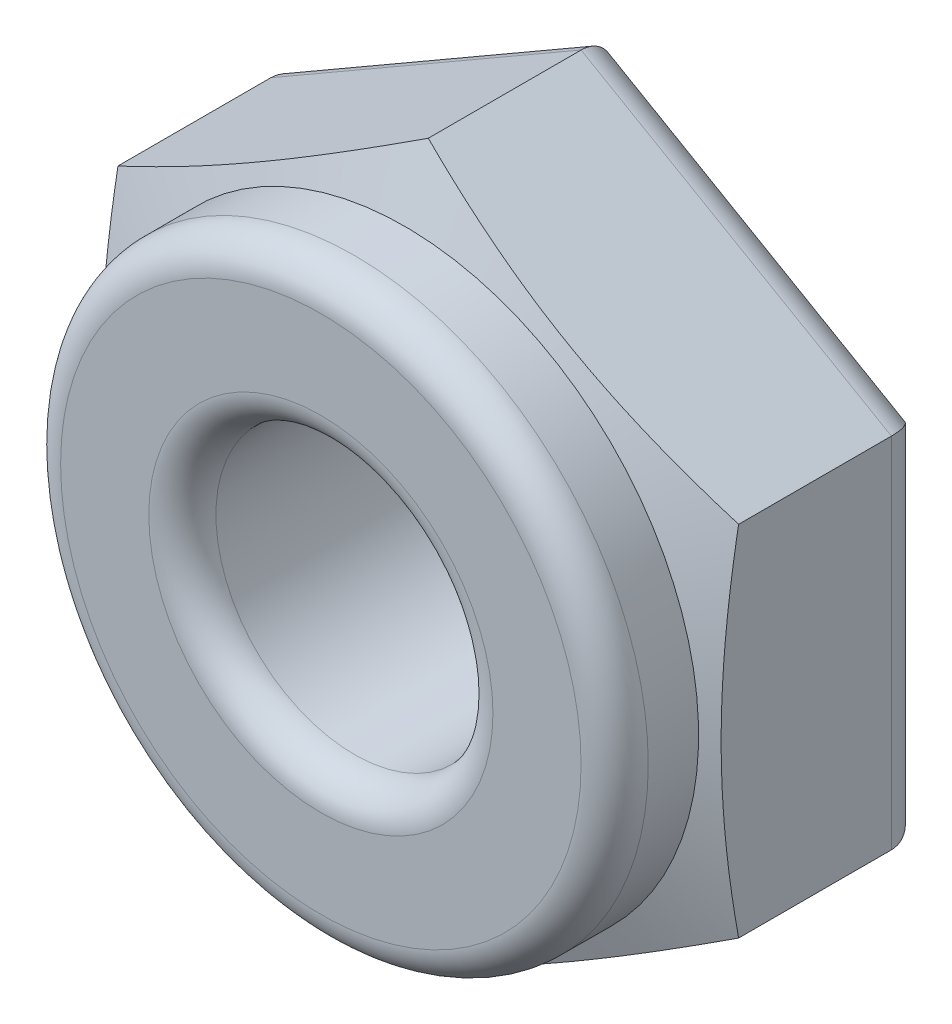
ISO-10303-21;
HEADER;
FILE_DESCRIPTION(('STEP AP214'),'2;1');
FILE_NAME('part.step','',(''),(''),'','','');
FILE_SCHEMA(('AUTOMOTIVE_DESIGN { 1 0 10303 214 1 1 1 1 }'));
ENDSEC;
DATA;
#1=APPLICATION_CONTEXT('core data for automotive mechanical design processes');
#2=APPLICATION_PROTOCOL_DEFINITION('international standard','automotive_design',2000,#1);
#3=PRODUCT_CONTEXT('',#1,'mechanical');
#4=PRODUCT('Part','Part','',(#3));
#5=PRODUCT_RELATED_PRODUCT_CATEGORY('part','',(#4));
#6=PRODUCT_DEFINITION_FORMATION('','',#4);
#7=PRODUCT_DEFINITION_CONTEXT('part definition',#1,'design');
#8=PRODUCT_DEFINITION('design','',#6,#7);
#9=PRODUCT_DEFINITION_SHAPE('','',#8);
#10=(LENGTH_UNIT() NAMED_UNIT(*) SI_UNIT(.MILLI.,.METRE.));
#11=(NAMED_UNIT(*) PLANE_ANGLE_UNIT() SI_UNIT($,.RADIAN.));
#12=(NAMED_UNIT(*) SI_UNIT($,.STERADIAN.) SOLID_ANGLE_UNIT());
#13=UNCERTAINTY_MEASURE_WITH_UNIT(LENGTH_MEASURE(1.E-05),#10,'distance_accuracy_value','');
#14=(GEOMETRIC_REPRESENTATION_CONTEXT(3) GLOBAL_UNCERTAINTY_ASSIGNED_CONTEXT((#13)) GLOBAL_UNIT_ASSIGNED_CONTEXT((#10,
#11,#12)) REPRESENTATION_CONTEXT('',''));
#15=CARTESIAN_POINT('',(0.,0.,0.));
#16=DIRECTION('',(0.,0.,1.));
#17=DIRECTION('',(1.,0.,0.));
#18=AXIS2_PLACEMENT_3D('',#15,#16,#17);
#19=CARTESIAN_POINT('',(0.,0.,4.445));
#20=DIRECTION('',(0.,0.,-1.));
#21=DIRECTION('',(-1.,0.,0.));
#22=AXIS2_PLACEMENT_3D('',#19,#20,#21);
#23=CYLINDRICAL_SURFACE('',#22,4.445);
#24=CARTESIAN_POINT('',(0.,0.,3.1749999999704));
#25=DIRECTION('',(0.,0.,-1.));
#26=DIRECTION('',(-1.,0.,0.));
#27=AXIS2_PLACEMENT_3D('',#24,#25,#26);
#28=CIRCLE('',#27,4.44499999997561);
#29=CARTESIAN_POINT('',(-4.44499999997561,0.,3.1749999999704));
#30=VERTEX_POINT('',#29);
#31=EDGE_CURVE('E308',#30,#30,#28,.T.);
#32=ORIENTED_EDGE('',*,*,#31,.F.);
#33=EDGE_LOOP('',(#32));
#34=FACE_BOUND('',#33,.T.);
#35=CARTESIAN_POINT('',(0.,0.,3.937));
#36=DIRECTION('',(0.,0.,1.));
#37=DIRECTION('',(1.,0.,0.));
#38=AXIS2_PLACEMENT_3D('',#35,#36,#37);
#39=CIRCLE('',#38,4.445);
#40=CARTESIAN_POINT('',(4.445,0.,3.937));
#41=VERTEX_POINT('',#40);
#42=EDGE_CURVE('E316',#41,#41,#39,.T.);
#43=ORIENTED_EDGE('',*,*,#42,.F.);
#44=EDGE_LOOP('',(#43));
#45=FACE_BOUND('',#44,.T.);
#46=ADVANCED_FACE('F17',(#34,#45),#23,.T.);
#47=CARTESIAN_POINT('',(0.,0.,3.937));
#48=DIRECTION('',(0.,0.,1.));
#49=DIRECTION('',(1.,0.,0.));
#50=AXIS2_PLACEMENT_3D('',#47,#48,#49);
#51=TOROIDAL_SURFACE('',#50,3.937,0.508);
#52=ORIENTED_EDGE('',*,*,#42,.T.);
#53=EDGE_LOOP('',(#52));
#54=FACE_BOUND('',#53,.T.);
#55=CARTESIAN_POINT('',(0.,0.,4.445));
#56=DIRECTION('',(0.,0.,-1.));
#57=DIRECTION('',(1.,0.,0.));
#58=AXIS2_PLACEMENT_3D('',#55,#56,#57);
#59=CIRCLE('',#58,3.937);
#60=CARTESIAN_POINT('',(-3.937,0.,4.445));
#61=VERTEX_POINT('',#60);
#62=CARTESIAN_POINT('',(3.937,0.,4.445));
#63=VERTEX_POINT('',#62);
#64=EDGE_CURVE('E123',#61,#63,#59,.F.);
#65=ORIENTED_EDGE('',*,*,#64,.F.);
#66=CARTESIAN_POINT('',(0.,0.,4.445));
#67=DIRECTION('',(0.,0.,-1.));
#68=DIRECTION('',(-1.,0.,0.));
#69=AXIS2_PLACEMENT_3D('',#66,#67,#68);
#70=CIRCLE('',#69,3.937);
#71=EDGE_CURVE('E96',#63,#61,#70,.F.);
#72=ORIENTED_EDGE('',*,*,#71,.F.);
#73=EDGE_LOOP('',(#65,#72));
#74=FACE_BOUND('',#73,.T.);
#75=ADVANCED_FACE('F163',(#54,#74),#51,.T.);
#76=CARTESIAN_POINT('',(0.,0.,2.81751682840081));
#77=DIRECTION('',(0.,0.,-1.));
#78=DIRECTION('',(-1.,0.,0.));
#79=AXIS2_PLACEMENT_3D('',#76,#77,#78);
#80=CONICAL_SURFACE('',#79,5.42717694173689,1.22173047639483);
#81=CARTESIAN_POINT('',(3.71810447639347E-12,-5.42131902768844,2.81964893474934));
#82=CARTESIAN_POINT('',(0.194430301531525,-5.30906464076274,2.86051962807064));
#83=CARTESIAN_POINT('',(0.389501710336724,-5.19644011037786,2.89769845795515));
#84=CARTESIAN_POINT('',(0.780912782140721,-4.97045882270802,2.96310868628109));
#85=CARTESIAN_POINT('',(0.977253315523539,-4.85710156290662,2.99133308472074));
#86=CARTESIAN_POINT('',(1.36902392099259,-4.63091269837848,3.03698517918679));
#87=CARTESIAN_POINT('',(1.56444504779066,-4.51808625821627,3.05451244013131));
#88=CARTESIAN_POINT('',(1.95574424899332,-4.29216955906824,3.07802140706483));
#89=CARTESIAN_POINT('',(2.15162212449666,-4.17907941491809,3.08400744141009));
#90=CARTESIAN_POINT('',(2.54337787550335,-3.95289912661779,3.08400744141009));
#91=CARTESIAN_POINT('',(2.73925575100669,-3.83980898246765,3.07802140706483));
#92=CARTESIAN_POINT('',(3.13055495220934,-3.61389228331961,3.05451244013131));
#93=CARTESIAN_POINT('',(3.32597607900741,-3.5010658431574,3.03698517918679));
#94=CARTESIAN_POINT('',(3.71774668447647,-3.27487697862926,2.99133308472074));
#95=CARTESIAN_POINT('',(3.91408721785928,-3.16151971882786,2.96310868628109));
#96=CARTESIAN_POINT('',(4.30549828966328,-2.93553843115802,2.89769845795515));
#97=CARTESIAN_POINT('',(4.50056969846848,-2.82291390077314,2.86051962807064));
#98=CARTESIAN_POINT('',(4.69499999999629,-2.71065951384744,2.81964893474934));
#99=B_SPLINE_CURVE_WITH_KNOTS('',3,(#81,#82,#83,#84,#85,#86,#87,#88,#89,#90,#91,#92,#93,#94,#95,
#96,#97,#98),.UNSPECIFIED.,.F.,.F.,(4,2,2,2,2,2,2,2,4),(0.,0.684666414958523,1.36986674698498,
2.04858815775377,2.72705497513833,3.40552179252289,4.08424320329169,4.76944353531814,
5.45410995027667),.UNSPECIFIED.);
#100=CARTESIAN_POINT('',(0.,-5.42131902768844,2.81964893474934));
#101=VERTEX_POINT('',#100);
#102=CARTESIAN_POINT('',(4.69499999999814,-2.71065951384422,2.81964893474934));
#103=VERTEX_POINT('',#102);
#104=EDGE_CURVE('E178',#101,#103,#99,.T.);
#105=ORIENTED_EDGE('',*,*,#104,.T.);
#106=CARTESIAN_POINT('',(4.695,-2.71065951384101,2.81964893474934));
#107=CARTESIAN_POINT('',(4.69500000000054,-2.48615073998959,2.86051962807102));
#108=CARTESIAN_POINT('',(4.69500000000027,-2.26090167921981,2.89769845795535));
#109=CARTESIAN_POINT('',(4.69499999999973,-1.80893910388025,2.96310868628089));
#110=CARTESIAN_POINT('',(4.69499999999946,-1.58222458427758,2.99133308472033));
#111=CARTESIAN_POINT('',(4.69500000000054,-1.12984685522145,3.03698517918714));
#112=CARTESIAN_POINT('',(4.69500000000187,-0.904193974897045,3.05451244013259));
#113=CARTESIAN_POINT('',(4.69499999999813,-0.452360576600855,3.07802140706352));
#114=CARTESIAN_POINT('',(4.69499999999306,-0.226180288300427,3.08400744140524));
#115=CARTESIAN_POINT('',(4.69499999999306,0.226180288300428,3.08400744140524));
#116=CARTESIAN_POINT('',(4.69499999999813,0.452360576600856,3.07802140706352));
#117=CARTESIAN_POINT('',(4.69500000000187,0.904193974897045,3.05451244013259));
#118=CARTESIAN_POINT('',(4.69500000000054,1.12984685522145,3.03698517918714));
#119=CARTESIAN_POINT('',(4.69499999999946,1.58222458427757,2.99133308472033));
#120=CARTESIAN_POINT('',(4.69499999999973,1.80893910388025,2.96310868628089));
#121=CARTESIAN_POINT('',(4.69500000000027,2.26090167921981,2.89769845795535));
#122=CARTESIAN_POINT('',(4.69500000000054,2.48615073998959,2.86051962807102));
#123=CARTESIAN_POINT('',(4.695,2.710659513841,2.81964893474935));
#124=B_SPLINE_CURVE_WITH_KNOTS('',3,(#106,#107,#108,#109,#110,#111,#112,#113,#114,#115,#116,
#117,#118,#119,#120,#121,#122,#123),.UNSPECIFIED.,.F.,.F.,(4,2,2,2,2,2,2,2,4),(0.,
0.684666414958581,1.36986674698462,2.04858815775341,2.72705497513821,3.40552179252301,
4.0842432032918,4.76944353531784,5.45410995027642),.UNSPECIFIED.);
#125=CARTESIAN_POINT('',(4.69499999999814,2.71065951384422,2.81964893474934));
#126=VERTEX_POINT('',#125);
#127=EDGE_CURVE('E170',#103,#126,#124,.T.);
#128=ORIENTED_EDGE('',*,*,#127,.T.);
#129=CARTESIAN_POINT('',(4.69499999999629,2.71065951384744,2.81964893474934));
#130=CARTESIAN_POINT('',(4.50056969846848,2.82291390077314,2.86051962807064));
#131=CARTESIAN_POINT('',(4.30549828966328,2.93553843115802,2.89769845795515));
#132=CARTESIAN_POINT('',(3.91408721785928,3.16151971882786,2.96310868628109));
#133=CARTESIAN_POINT('',(3.71774668447646,3.27487697862926,2.99133308472074));
#134=CARTESIAN_POINT('',(3.32597607900741,3.5010658431574,3.03698517918679));
#135=CARTESIAN_POINT('',(3.13055495220934,3.61389228331961,3.05451244013131));
#136=CARTESIAN_POINT('',(2.73925575100669,3.83980898246764,3.07802140706484));
#137=CARTESIAN_POINT('',(2.54337787550334,3.95289912661779,3.08400744141009));
#138=CARTESIAN_POINT('',(2.15162212449665,4.17907941491809,3.08400744141009));
#139=CARTESIAN_POINT('',(1.95574424899331,4.29216955906824,3.07802140706484));
#140=CARTESIAN_POINT('',(1.56444504779066,4.51808625821627,3.05451244013131));
#141=CARTESIAN_POINT('',(1.36902392099259,4.63091269837848,3.03698517918679));
#142=CARTESIAN_POINT('',(0.977253315523533,4.85710156290662,2.99133308472074));
#143=CARTESIAN_POINT('',(0.780912782140716,4.97045882270802,2.96310868628109));
#144=CARTESIAN_POINT('',(0.389501710336718,5.19644011037786,2.89769845795515));
#145=CARTESIAN_POINT('',(0.194430301531519,5.30906464076274,2.86051962807064));
#146=CARTESIAN_POINT('',(3.71111817945786E-12,5.42131902768844,2.81964893474934));
#147=B_SPLINE_CURVE_WITH_KNOTS('',3,(#129,#130,#131,#132,#133,#134,#135,#136,#137,#138,#139,
#140,#141,#142,#143,#144,#145,#146),.UNSPECIFIED.,.F.,.F.,(4,2,2,2,2,2,2,2,4),(0.,
0.684666414958524,1.36986674698498,2.04858815775377,2.72705497513834,3.4055217925229,
4.08424320329169,4.76944353531815,5.45410995027667),.UNSPECIFIED.);
#148=CARTESIAN_POINT('',(0.,5.42131902768844,2.81964893474934));
#149=VERTEX_POINT('',#148);
#150=EDGE_CURVE('E137',#126,#149,#147,.T.);
#151=ORIENTED_EDGE('',*,*,#150,.T.);
#152=CARTESIAN_POINT('',(-3.71804924842512E-12,5.42131902768844,2.81964893474934));
#153=CARTESIAN_POINT('',(-0.194430301531526,5.30906464076274,2.86051962807064));
#154=CARTESIAN_POINT('',(-0.389501710336725,5.19644011037786,2.89769845795515));
#155=CARTESIAN_POINT('',(-0.780912782140722,4.97045882270802,2.96310868628109));
#156=CARTESIAN_POINT('',(-0.97725331552354,4.85710156290662,2.99133308472074));
#157=CARTESIAN_POINT('',(-1.36902392099259,4.63091269837848,3.03698517918679));
#158=CARTESIAN_POINT('',(-1.56444504779067,4.51808625821627,3.05451244013131));
#159=CARTESIAN_POINT('',(-1.95574424899332,4.29216955906824,3.07802140706484));
#160=CARTESIAN_POINT('',(-2.15162212449666,4.17907941491809,3.08400744141009));
#161=CARTESIAN_POINT('',(-2.54337787550335,3.95289912661779,3.08400744141009));
#162=CARTESIAN_POINT('',(-2.73925575100669,3.83980898246765,3.07802140706484));
#163=CARTESIAN_POINT('',(-3.13055495220934,3.61389228331961,3.05451244013131));
#164=CARTESIAN_POINT('',(-3.32597607900742,3.5010658431574,3.03698517918679));
#165=CARTESIAN_POINT('',(-3.71774668447647,3.27487697862926,2.99133308472074));
#166=CARTESIAN_POINT('',(-3.91408721785929,3.16151971882786,2.96310868628109));
#167=CARTESIAN_POINT('',(-4.30549828966328,2.93553843115802,2.89769845795515));
#168=CARTESIAN_POINT('',(-4.50056969846848,2.82291390077314,2.86051962807064));
#169=CARTESIAN_POINT('',(-4.69499999999629,2.71065951384744,2.81964893474934));
#170=B_SPLINE_CURVE_WITH_KNOTS('',3,(#152,#153,#154,#155,#156,#157,#158,#159,#160,#161,#162,
#163,#164,#165,#166,#167,#168,#169),.UNSPECIFIED.,.F.,.F.,(4,2,2,2,2,2,2,2,4),(0.,
0.684666414958524,1.36986674698498,2.04858815775377,2.72705497513833,3.4055217925229,
4.08424320329169,4.76944353531814,5.45410995027667),.UNSPECIFIED.);
#171=CARTESIAN_POINT('',(-4.695,2.71065951384315,2.81964893474895));
#172=VERTEX_POINT('',#171);
#173=EDGE_CURVE('E128',#149,#172,#170,.T.);
#174=ORIENTED_EDGE('',*,*,#173,.T.);
#175=CARTESIAN_POINT('',(-4.695,2.71065951384101,2.81964893474934));
#176=CARTESIAN_POINT('',(-4.69500000000054,2.48615073998959,2.86051962807102));
#177=CARTESIAN_POINT('',(-4.69500000000027,2.26090167921981,2.89769845795534));
#178=CARTESIAN_POINT('',(-4.69499999999973,1.80893910388025,2.96310868628089));
#179=CARTESIAN_POINT('',(-4.69499999999946,1.58222458427758,2.99133308472033));
#180=CARTESIAN_POINT('',(-4.69500000000054,1.12984685522145,3.03698517918714));
#181=CARTESIAN_POINT('',(-4.69500000000187,0.904193974897046,3.05451244013259));
#182=CARTESIAN_POINT('',(-4.69499999999813,0.452360576600855,3.07802140706352));
#183=CARTESIAN_POINT('',(-4.69499999999307,0.226180288300427,3.08400744140524));
#184=CARTESIAN_POINT('',(-4.69499999999307,-0.226180288300428,3.08400744140524));
#185=CARTESIAN_POINT('',(-4.69499999999813,-0.452360576600856,3.07802140706352));
#186=CARTESIAN_POINT('',(-4.69500000000187,-0.904193974897046,3.05451244013259));
#187=CARTESIAN_POINT('',(-4.69500000000054,-1.12984685522145,3.03698517918714));
#188=CARTESIAN_POINT('',(-4.69499999999946,-1.58222458427758,2.99133308472033));
#189=CARTESIAN_POINT('',(-4.69499999999973,-1.80893910388025,2.96310868628089));
#190=CARTESIAN_POINT('',(-4.69500000000027,-2.26090167921981,2.89769845795535));
#191=CARTESIAN_POINT('',(-4.69500000000054,-2.48615073998959,2.86051962807102));
#192=CARTESIAN_POINT('',(-4.695,-2.710659513841,2.81964893474934));
#193=B_SPLINE_CURVE_WITH_KNOTS('',3,(#175,#176,#177,#178,#179,#180,#181,#182,#183,#184,#185,
#186,#187,#188,#189,#190,#191,#192),.UNSPECIFIED.,.F.,.F.,(4,2,2,2,2,2,2,2,4),(0.,
0.684666414958581,1.36986674698462,2.04858815775341,2.72705497513821,3.40552179252301,
4.0842432032918,4.76944353531784,5.45410995027642),.UNSPECIFIED.);
#194=CARTESIAN_POINT('',(-4.69499999999814,-2.71065951384422,2.81964893474934));
#195=VERTEX_POINT('',#194);
#196=EDGE_CURVE('E114',#172,#195,#193,.T.);
#197=ORIENTED_EDGE('',*,*,#196,.T.);
#198=CARTESIAN_POINT('',(-4.69499999999629,-2.71065951384744,2.81964893474934));
#199=CARTESIAN_POINT('',(-4.50056969846848,-2.82291390077314,2.86051962807064));
#200=CARTESIAN_POINT('',(-4.30549828966328,-2.93553843115802,2.89769845795515));
#201=CARTESIAN_POINT('',(-3.91408721785928,-3.16151971882786,2.96310868628109));
#202=CARTESIAN_POINT('',(-3.71774668447647,-3.27487697862926,2.99133308472074));
#203=CARTESIAN_POINT('',(-3.32597607900741,-3.5010658431574,3.03698517918679));
#204=CARTESIAN_POINT('',(-3.13055495220934,-3.61389228331961,3.05451244013131));
#205=CARTESIAN_POINT('',(-2.73925575100669,-3.83980898246765,3.07802140706484));
#206=CARTESIAN_POINT('',(-2.54337787550334,-3.95289912661779,3.08400744141009));
#207=CARTESIAN_POINT('',(-2.15162212449666,-4.17907941491809,3.08400744141009));
#208=CARTESIAN_POINT('',(-1.95574424899331,-4.29216955906824,3.07802140706484));
#209=CARTESIAN_POINT('',(-1.56444504779066,-4.51808625821627,3.05451244013131));
#210=CARTESIAN_POINT('',(-1.36902392099259,-4.63091269837848,3.03698517918679));
#211=CARTESIAN_POINT('',(-0.977253315523533,-4.85710156290662,2.99133308472074));
#212=CARTESIAN_POINT('',(-0.780912782140716,-4.97045882270803,2.96310868628109));
#213=CARTESIAN_POINT('',(-0.389501710336718,-5.19644011037787,2.89769845795515));
#214=CARTESIAN_POINT('',(-0.194430301531519,-5.30906464076275,2.86051962807064));
#215=CARTESIAN_POINT('',(-3.71106865737092E-12,-5.42131902768845,2.81964893474934));
#216=B_SPLINE_CURVE_WITH_KNOTS('',3,(#198,#199,#200,#201,#202,#203,#204,#205,#206,#207,#208,
#209,#210,#211,#212,#213,#214,#215),.UNSPECIFIED.,.F.,.F.,(4,2,2,2,2,2,2,2,4),(0.,
0.684666414958525,1.36986674698498,2.04858815775378,2.72705497513834,3.4055217925229,
4.08424320329169,4.76944353531815,5.45410995027668),.UNSPECIFIED.);
#217=EDGE_CURVE('E89',#195,#101,#216,.T.);
#218=ORIENTED_EDGE('',*,*,#217,.T.);
#219=EDGE_LOOP('',(#105,#128,#151,#174,#197,#218));
#220=FACE_BOUND('',#219,.T.);
#221=ORIENTED_EDGE('',*,*,#31,.T.);
#222=EDGE_LOOP('',(#221));
#223=FACE_BOUND('',#222,.T.);
#224=ADVANCED_FACE('F134',(#220,#223),#80,.T.);
#225=CARTESIAN_POINT('',(0.,0.,4.445));
#226=DIRECTION('',(0.,0.,1.));
#227=DIRECTION('',(1.,0.,0.));
#228=AXIS2_PLACEMENT_3D('',#225,#226,#227);
#229=PLANE('',#228);
#230=ORIENTED_EDGE('',*,*,#71,.T.);
#231=ORIENTED_EDGE('',*,*,#64,.T.);
#232=EDGE_LOOP('',(#230,#231));
#233=FACE_BOUND('',#232,.T.);
#234=CARTESIAN_POINT('',(0.,0.,4.445));
#235=DIRECTION('',(0.,0.,1.));
#236=DIRECTION('',(-1.,0.,0.));
#237=AXIS2_PLACEMENT_3D('',#234,#235,#236);
#238=CIRCLE('',#237,2.6035);
#239=CARTESIAN_POINT('',(-2.6035,0.,4.445));
#240=VERTEX_POINT('',#239);
#241=CARTESIAN_POINT('',(2.6035,0.,4.445));
#242=VERTEX_POINT('',#241);
#243=EDGE_CURVE('E107',#240,#242,#238,.T.);
#244=ORIENTED_EDGE('',*,*,#243,.F.);
#245=CARTESIAN_POINT('',(0.,0.,4.445));
#246=DIRECTION('',(0.,0.,1.));
#247=DIRECTION('',(1.,0.,0.));
#248=AXIS2_PLACEMENT_3D('',#245,#246,#247);
#249=CIRCLE('',#248,2.6035);
#250=EDGE_CURVE('E268',#242,#240,#249,.T.);
#251=ORIENTED_EDGE('',*,*,#250,.F.);
#252=EDGE_LOOP('',(#244,#251));
#253=FACE_BOUND('',#252,.T.);
#254=ADVANCED_FACE('F162',(#233,#253),#229,.T.);
#255=CARTESIAN_POINT('',(-4.695,2.71065951384529,3.175));
#256=DIRECTION('',(1.,0.,0.));
#257=DIRECTION('',(0.,1.,0.));
#258=AXIS2_PLACEMENT_3D('',#255,#256,#257);
#259=PLANE('',#258);
#260=DIRECTION('',(0.,-1.,0.));
#261=VECTOR('',#260,1.);
#262=CARTESIAN_POINT('',(-4.695,2.71065951384529,0.508));
#263=LINE('',#262,#261);
#264=CARTESIAN_POINT('',(-4.695,-2.71065951384529,0.508));
#265=VERTEX_POINT('',#264);
#266=CARTESIAN_POINT('',(-4.695,2.71065951384529,0.508));
#267=VERTEX_POINT('',#266);
#268=EDGE_CURVE('E340',#265,#267,#263,.F.);
#269=ORIENTED_EDGE('',*,*,#268,.F.);
#270=DIRECTION('',(0.,0.,1.));
#271=VECTOR('',#270,1.);
#272=CARTESIAN_POINT('',(-4.695,-2.71065951384529,3.175));
#273=LINE('',#272,#271);
#274=EDGE_CURVE('E120',#265,#195,#273,.T.);
#275=ORIENTED_EDGE('',*,*,#274,.T.);
#276=ORIENTED_EDGE('',*,*,#196,.F.);
#277=DIRECTION('',(0.,0.,1.));
#278=VECTOR('',#277,1.);
#279=CARTESIAN_POINT('',(-4.695,2.71065951384529,3.175));
#280=LINE('',#279,#278);
#281=EDGE_CURVE('E118',#172,#267,#280,.F.);
#282=ORIENTED_EDGE('',*,*,#281,.T.);
#283=EDGE_LOOP('',(#269,#275,#276,#282));
#284=FACE_BOUND('',#283,.T.);
#285=ADVANCED_FACE('F117',(#284),#259,.F.);
#286=CARTESIAN_POINT('',(-4.695,-2.71065951384529,3.175));
#287=DIRECTION('',(0.5,0.866025403784439,0.));
#288=DIRECTION('',(-0.866025403784439,0.5,0.));
#289=AXIS2_PLACEMENT_3D('',#286,#287,#288);
#290=PLANE('',#289);
#291=DIRECTION('',(0.866025403784439,-0.5,0.));
#292=VECTOR('',#291,1.);
#293=CARTESIAN_POINT('',(-4.695,-2.71065951384529,0.508));
#294=LINE('',#293,#292);
#295=CARTESIAN_POINT('',(0.,-5.42131902769059,0.508));
#296=VERTEX_POINT('',#295);
#297=EDGE_CURVE('E330',#296,#265,#294,.F.);
#298=ORIENTED_EDGE('',*,*,#297,.F.);
#299=DIRECTION('',(0.,0.,1.));
#300=VECTOR('',#299,1.);
#301=CARTESIAN_POINT('',(0.,-5.42131902769059,3.175));
#302=LINE('',#301,#300);
#303=EDGE_CURVE('E254',#296,#101,#302,.T.);
#304=ORIENTED_EDGE('',*,*,#303,.T.);
#305=ORIENTED_EDGE('',*,*,#217,.F.);
#306=ORIENTED_EDGE('',*,*,#274,.F.);
#307=EDGE_LOOP('',(#298,#304,#305,#306));
#308=FACE_BOUND('',#307,.T.);
#309=ADVANCED_FACE('F192',(#308),#290,.F.);
#310=CARTESIAN_POINT('',(0.,-5.42131902769059,3.175));
#311=DIRECTION('',(-0.5,0.866025403784439,0.));
#312=DIRECTION('',(-0.866025403784439,-0.5,0.));
#313=AXIS2_PLACEMENT_3D('',#310,#311,#312);
#314=PLANE('',#313);
#315=DIRECTION('',(0.866025403784439,0.5,0.));
#316=VECTOR('',#315,1.);
#317=CARTESIAN_POINT('',(0.,-5.42131902769059,0.508));
#318=LINE('',#317,#316);
#319=CARTESIAN_POINT('',(4.695,-2.7106595138453,0.508));
#320=VERTEX_POINT('',#319);
#321=EDGE_CURVE('E328',#320,#296,#318,.F.);
#322=ORIENTED_EDGE('',*,*,#321,.F.);
#323=DIRECTION('',(0.,0.,1.));
#324=VECTOR('',#323,1.);
#325=CARTESIAN_POINT('',(4.695,-2.7106595138453,3.175));
#326=LINE('',#325,#324);
#327=EDGE_CURVE('E251',#320,#103,#326,.T.);
#328=ORIENTED_EDGE('',*,*,#327,.T.);
#329=ORIENTED_EDGE('',*,*,#104,.F.);
#330=ORIENTED_EDGE('',*,*,#303,.F.);
#331=EDGE_LOOP('',(#322,#328,#329,#330));
#332=FACE_BOUND('',#331,.T.);
#333=ADVANCED_FACE('F195',(#332),#314,.F.);
#334=CARTESIAN_POINT('',(4.695,-2.7106595138453,3.175));
#335=DIRECTION('',(-1.,0.,0.));
#336=DIRECTION('',(0.,-1.,0.));
#337=AXIS2_PLACEMENT_3D('',#334,#335,#336);
#338=PLANE('',#337);
#339=DIRECTION('',(0.,1.,0.));
#340=VECTOR('',#339,1.);
#341=CARTESIAN_POINT('',(4.695,-2.7106595138453,0.508));
#342=LINE('',#341,#340);
#343=CARTESIAN_POINT('',(4.695,2.71065951384529,0.508));
#344=VERTEX_POINT('',#343);
#345=EDGE_CURVE('E326',#344,#320,#342,.F.);
#346=ORIENTED_EDGE('',*,*,#345,.F.);
#347=DIRECTION('',(0.,0.,1.));
#348=VECTOR('',#347,1.);
#349=CARTESIAN_POINT('',(4.695,2.71065951384529,3.175));
#350=LINE('',#349,#348);
#351=EDGE_CURVE('E139',#344,#126,#350,.T.);
#352=ORIENTED_EDGE('',*,*,#351,.T.);
#353=ORIENTED_EDGE('',*,*,#127,.F.);
#354=ORIENTED_EDGE('',*,*,#327,.F.);
#355=EDGE_LOOP('',(#346,#352,#353,#354));
#356=FACE_BOUND('',#355,.T.);
#357=ADVANCED_FACE('F372',(#356),#338,.F.);
#358=CARTESIAN_POINT('',(4.695,2.71065951384529,3.175));
#359=DIRECTION('',(-0.5,-0.866025403784439,0.));
#360=DIRECTION('',(0.866025403784439,-0.5,0.));
#361=AXIS2_PLACEMENT_3D('',#358,#359,#360);
#362=PLANE('',#361);
#363=DIRECTION('',(-0.866025403784439,0.5,0.));
#364=VECTOR('',#363,1.);
#365=CARTESIAN_POINT('',(4.695,2.71065951384529,0.508));
#366=LINE('',#365,#364);
#367=CARTESIAN_POINT('',(0.,5.42131902769059,0.508));
#368=VERTEX_POINT('',#367);
#369=EDGE_CURVE('E323',#368,#344,#366,.F.);
#370=ORIENTED_EDGE('',*,*,#369,.F.);
#371=DIRECTION('',(0.,0.,1.));
#372=VECTOR('',#371,1.);
#373=CARTESIAN_POINT('',(0.,5.42131902769059,3.175));
#374=LINE('',#373,#372);
#375=EDGE_CURVE('E131',#368,#149,#374,.T.);
#376=ORIENTED_EDGE('',*,*,#375,.T.);
#377=ORIENTED_EDGE('',*,*,#150,.F.);
#378=ORIENTED_EDGE('',*,*,#351,.F.);
#379=EDGE_LOOP('',(#370,#376,#377,#378));
#380=FACE_BOUND('',#379,.T.);
#381=ADVANCED_FACE('F374',(#380),#362,.F.);
#382=CARTESIAN_POINT('',(0.,5.42131902769059,3.175));
#383=DIRECTION('',(0.5,-0.866025403784439,0.));
#384=DIRECTION('',(0.866025403784439,0.5,0.));
#385=AXIS2_PLACEMENT_3D('',#382,#383,#384);
#386=PLANE('',#385);
#387=DIRECTION('',(-0.866025403784439,-0.5,0.));
#388=VECTOR('',#387,1.);
#389=CARTESIAN_POINT('',(0.,5.42131902769059,0.508));
#390=LINE('',#389,#388);
#391=EDGE_CURVE('E130',#267,#368,#390,.F.);
#392=ORIENTED_EDGE('',*,*,#391,.F.);
#393=ORIENTED_EDGE('',*,*,#281,.F.);
#394=ORIENTED_EDGE('',*,*,#173,.F.);
#395=ORIENTED_EDGE('',*,*,#375,.F.);
#396=EDGE_LOOP('',(#392,#393,#394,#395));
#397=FACE_BOUND('',#396,.T.);
#398=ADVANCED_FACE('F126',(#397),#386,.F.);
#399=CARTESIAN_POINT('',(0.,0.,3.937));
#400=DIRECTION('',(0.,0.,1.));
#401=DIRECTION('',(1.,0.,0.));
#402=AXIS2_PLACEMENT_3D('',#399,#400,#401);
#403=TOROIDAL_SURFACE('',#402,2.6035,0.508);
#404=CARTESIAN_POINT('',(0.,0.,3.937));
#405=DIRECTION('',(0.,0.,1.));
#406=DIRECTION('',(1.,0.,0.));
#407=AXIS2_PLACEMENT_3D('',#404,#405,#406);
#408=CIRCLE('',#407,2.0955);
#409=CARTESIAN_POINT('',(2.0955,0.,3.937));
#410=VERTEX_POINT('',#409);
#411=EDGE_CURVE('E248',#410,#410,#408,.F.);
#412=ORIENTED_EDGE('',*,*,#411,.T.);
#413=EDGE_LOOP('',(#412));
#414=FACE_BOUND('',#413,.T.);
#415=ORIENTED_EDGE('',*,*,#250,.T.);
#416=ORIENTED_EDGE('',*,*,#243,.T.);
#417=EDGE_LOOP('',(#415,#416));
#418=FACE_BOUND('',#417,.T.);
#419=ADVANCED_FACE('F237',(#414,#418),#403,.T.);
#420=CARTESIAN_POINT('',(-4.187,2.71065951384529,0.508));
#421=DIRECTION('',(0.,-1.,0.));
#422=DIRECTION('',(1.,0.,0.));
#423=AXIS2_PLACEMENT_3D('',#420,#421,#422);
#424=CYLINDRICAL_SURFACE('',#423,0.508);
#425=CARTESIAN_POINT('',(-4.187,2.41736557709696,0.508));
#426=DIRECTION('',(-0.5,-0.866025403784439,0.));
#427=DIRECTION('',(-0.866025403784439,0.5,0.));
#428=AXIS2_PLACEMENT_3D('',#425,#426,#427);
#429=ELLIPSE('',#428,0.58658787349666,0.508);
#430=CARTESIAN_POINT('',(-4.187,2.41736557709696,0.));
#431=VERTEX_POINT('',#430);
#432=EDGE_CURVE('E320',#431,#267,#429,.F.);
#433=ORIENTED_EDGE('',*,*,#432,.F.);
#434=DIRECTION('',(0.,1.,0.));
#435=VECTOR('',#434,1.);
#436=CARTESIAN_POINT('',(-4.187,-5.42131902769059,0.));
#437=LINE('',#436,#435);
#438=CARTESIAN_POINT('',(-4.187,-2.41736557709696,0.));
#439=VERTEX_POINT('',#438);
#440=EDGE_CURVE('E354',#431,#439,#437,.F.);
#441=ORIENTED_EDGE('',*,*,#440,.T.);
#442=CARTESIAN_POINT('',(-4.187,-2.41736557709696,0.508));
#443=DIRECTION('',(0.5,-0.866025403784439,0.));
#444=DIRECTION('',(0.866025403784439,0.5,0.));
#445=AXIS2_PLACEMENT_3D('',#442,#443,#444);
#446=ELLIPSE('',#445,0.58658787349666,0.508);
#447=EDGE_CURVE('E150',#265,#439,#446,.T.);
#448=ORIENTED_EDGE('',*,*,#447,.F.);
#449=ORIENTED_EDGE('',*,*,#268,.T.);
#450=EDGE_LOOP('',(#433,#441,#448,#449));
#451=FACE_BOUND('',#450,.T.);
#452=ADVANCED_FACE('F234',(#451),#424,.T.);
#453=CARTESIAN_POINT('',(-4.441,-2.2707186087228,0.508));
#454=DIRECTION('',(0.866025403784439,-0.5,0.));
#455=DIRECTION('',(0.5,0.866025403784439,0.));
#456=AXIS2_PLACEMENT_3D('',#453,#454,#455);
#457=CYLINDRICAL_SURFACE('',#456,0.508);
#458=CARTESIAN_POINT('',(0.,-4.83473115419393,0.508));
#459=DIRECTION('',(1.,0.,0.));
#460=DIRECTION('',(0.,1.,0.));
#461=AXIS2_PLACEMENT_3D('',#458,#459,#460);
#462=ELLIPSE('',#461,0.58658787349666,0.508);
#463=CARTESIAN_POINT('',(0.,-4.83473115419393,0.));
#464=VERTEX_POINT('',#463);
#465=EDGE_CURVE('E329',#296,#464,#462,.T.);
#466=ORIENTED_EDGE('',*,*,#465,.F.);
#467=ORIENTED_EDGE('',*,*,#297,.T.);
#468=ORIENTED_EDGE('',*,*,#447,.T.);
#469=DIRECTION('',(0.866025403784439,-0.5,0.));
#470=VECTOR('',#469,1.);
#471=CARTESIAN_POINT('',(-4.187,-2.41736557709696,0.));
#472=LINE('',#471,#470);
#473=EDGE_CURVE('E342',#439,#464,#472,.T.);
#474=ORIENTED_EDGE('',*,*,#473,.T.);
#475=EDGE_LOOP('',(#466,#467,#468,#474));
#476=FACE_BOUND('',#475,.T.);
#477=ADVANCED_FACE('F230',(#476),#457,.T.);
#478=CARTESIAN_POINT('',(-0.254,-4.98137812256809,0.508));
#479=DIRECTION('',(0.866025403784439,0.5,0.));
#480=DIRECTION('',(-0.5,0.866025403784439,0.));
#481=AXIS2_PLACEMENT_3D('',#478,#479,#480);
#482=CYLINDRICAL_SURFACE('',#481,0.508);
#483=CARTESIAN_POINT('',(4.187,-2.41736557709697,0.508));
#484=DIRECTION('',(0.5,0.866025403784439,0.));
#485=DIRECTION('',(-0.866025403784439,0.5,0.));
#486=AXIS2_PLACEMENT_3D('',#483,#484,#485);
#487=ELLIPSE('',#486,0.58658787349666,0.508);
#488=CARTESIAN_POINT('',(4.187,-2.41736557709697,0.));
#489=VERTEX_POINT('',#488);
#490=EDGE_CURVE('E327',#320,#489,#487,.T.);
#491=ORIENTED_EDGE('',*,*,#490,.F.);
#492=ORIENTED_EDGE('',*,*,#321,.T.);
#493=ORIENTED_EDGE('',*,*,#465,.T.);
#494=DIRECTION('',(0.866025403784439,0.5,0.));
#495=VECTOR('',#494,1.);
#496=CARTESIAN_POINT('',(0.,-4.83473115419393,0.));
#497=LINE('',#496,#495);
#498=EDGE_CURVE('E360',#464,#489,#497,.T.);
#499=ORIENTED_EDGE('',*,*,#498,.T.);
#500=EDGE_LOOP('',(#491,#492,#493,#499));
#501=FACE_BOUND('',#500,.T.);
#502=ADVANCED_FACE('F226',(#501),#482,.T.);
#503=CARTESIAN_POINT('',(4.187,-2.7106595138453,0.508));
#504=DIRECTION('',(0.,1.,0.));
#505=DIRECTION('',(-1.,0.,0.));
#506=AXIS2_PLACEMENT_3D('',#503,#504,#505);
#507=CYLINDRICAL_SURFACE('',#506,0.508);
#508=CARTESIAN_POINT('',(4.187,2.41736557709696,0.508));
#509=DIRECTION('',(-0.5,0.866025403784439,0.));
#510=DIRECTION('',(-0.866025403784439,-0.5,0.));
#511=AXIS2_PLACEMENT_3D('',#508,#509,#510);
#512=ELLIPSE('',#511,0.58658787349666,0.508);
#513=CARTESIAN_POINT('',(4.187,2.41736557709696,0.));
#514=VERTEX_POINT('',#513);
#515=EDGE_CURVE('E324',#344,#514,#512,.T.);
#516=ORIENTED_EDGE('',*,*,#515,.F.);
#517=ORIENTED_EDGE('',*,*,#345,.T.);
#518=ORIENTED_EDGE('',*,*,#490,.T.);
#519=DIRECTION('',(0.,1.,0.));
#520=VECTOR('',#519,1.);
#521=CARTESIAN_POINT('',(4.187,-5.42131902769059,0.));
#522=LINE('',#521,#520);
#523=EDGE_CURVE('E350',#489,#514,#522,.T.);
#524=ORIENTED_EDGE('',*,*,#523,.T.);
#525=EDGE_LOOP('',(#516,#517,#518,#524));
#526=FACE_BOUND('',#525,.T.);
#527=ADVANCED_FACE('F222',(#526),#507,.T.);
#528=CARTESIAN_POINT('',(4.441,2.2707186087228,0.508));
#529=DIRECTION('',(-0.866025403784439,0.5,0.));
#530=DIRECTION('',(-0.5,-0.866025403784439,0.));
#531=AXIS2_PLACEMENT_3D('',#528,#529,#530);
#532=CYLINDRICAL_SURFACE('',#531,0.508);
#533=CARTESIAN_POINT('',(0.,4.83473115419393,0.508));
#534=DIRECTION('',(-1.,0.,0.));
#535=DIRECTION('',(0.,-1.,0.));
#536=AXIS2_PLACEMENT_3D('',#533,#534,#535);
#537=ELLIPSE('',#536,0.58658787349666,0.508);
#538=CARTESIAN_POINT('',(0.,4.83473115419393,0.));
#539=VERTEX_POINT('',#538);
#540=EDGE_CURVE('E36',#368,#539,#537,.T.);
#541=ORIENTED_EDGE('',*,*,#540,.F.);
#542=ORIENTED_EDGE('',*,*,#369,.T.);
#543=ORIENTED_EDGE('',*,*,#515,.T.);
#544=DIRECTION('',(-0.866025403784439,0.5,0.));
#545=VECTOR('',#544,1.);
#546=CARTESIAN_POINT('',(4.187,2.41736557709696,0.));
#547=LINE('',#546,#545);
#548=EDGE_CURVE('E348',#514,#539,#547,.T.);
#549=ORIENTED_EDGE('',*,*,#548,.T.);
#550=EDGE_LOOP('',(#541,#542,#543,#549));
#551=FACE_BOUND('',#550,.T.);
#552=ADVANCED_FACE('F219',(#551),#532,.T.);
#553=CARTESIAN_POINT('',(0.253999999999997,4.98137812256809,0.508));
#554=DIRECTION('',(-0.866025403784439,-0.5,0.));
#555=DIRECTION('',(0.5,-0.866025403784439,0.));
#556=AXIS2_PLACEMENT_3D('',#553,#554,#555);
#557=CYLINDRICAL_SURFACE('',#556,0.508);
#558=ORIENTED_EDGE('',*,*,#540,.T.);
#559=DIRECTION('',(-0.866025403784439,-0.5,0.));
#560=VECTOR('',#559,1.);
#561=CARTESIAN_POINT('',(0.,4.83473115419393,0.));
#562=LINE('',#561,#560);
#563=EDGE_CURVE('E27',#539,#431,#562,.T.);
#564=ORIENTED_EDGE('',*,*,#563,.T.);
#565=ORIENTED_EDGE('',*,*,#432,.T.);
#566=ORIENTED_EDGE('',*,*,#391,.T.);
#567=EDGE_LOOP('',(#558,#564,#565,#566));
#568=FACE_BOUND('',#567,.T.);
#569=ADVANCED_FACE('F211',(#568),#557,.T.);
#570=CARTESIAN_POINT('',(0.,0.,0.));
#571=DIRECTION('',(0.,0.,1.));
#572=DIRECTION('',(1.,0.,0.));
#573=AXIS2_PLACEMENT_3D('',#570,#571,#572);
#574=CYLINDRICAL_SURFACE('',#573,2.0955);
#575=CARTESIAN_POINT('',(0.,0.,0.));
#576=DIRECTION('',(0.,0.,1.));
#577=DIRECTION('',(1.,0.,0.));
#578=AXIS2_PLACEMENT_3D('',#575,#576,#577);
#579=CIRCLE('',#578,2.0955);
#580=CARTESIAN_POINT('',(2.0955,0.,0.));
#581=VERTEX_POINT('',#580);
#582=EDGE_CURVE('E11',#581,#581,#579,.F.);
#583=ORIENTED_EDGE('',*,*,#582,.T.);
#584=EDGE_LOOP('',(#583));
#585=FACE_BOUND('',#584,.T.);
#586=ORIENTED_EDGE('',*,*,#411,.F.);
#587=EDGE_LOOP('',(#586));
#588=FACE_BOUND('',#587,.T.);
#589=ADVANCED_FACE('F205',(#585,#588),#574,.F.);
#590=CARTESIAN_POINT('',(0.,-5.42131902769059,0.));
#591=DIRECTION('',(0.,0.,1.));
#592=DIRECTION('',(1.,0.,0.));
#593=AXIS2_PLACEMENT_3D('',#590,#591,#592);
#594=PLANE('',#593);
#595=ORIENTED_EDGE('',*,*,#582,.F.);
#596=EDGE_LOOP('',(#595));
#597=FACE_BOUND('',#596,.T.);
#598=ORIENTED_EDGE('',*,*,#548,.F.);
#599=ORIENTED_EDGE('',*,*,#523,.F.);
#600=ORIENTED_EDGE('',*,*,#498,.F.);
#601=ORIENTED_EDGE('',*,*,#473,.F.);
#602=ORIENTED_EDGE('',*,*,#440,.F.);
#603=ORIENTED_EDGE('',*,*,#563,.F.);
#604=EDGE_LOOP('',(#598,#599,#600,#601,#602,#603));
#605=FACE_BOUND('',#604,.T.);
#606=ADVANCED_FACE('F203',(#597,#605),#594,.F.);
#607=CLOSED_SHELL('',(#46,#75,#224,#254,#285,#309,#333,#357,#381,#398,#419,#452,#477,#502,#527,
#552,#569,#589,#606));
#608=MANIFOLD_SOLID_BREP('B1',#607);
#609=ADVANCED_BREP_SHAPE_REPRESENTATION('',(#18,#608),#14);
#610=SHAPE_DEFINITION_REPRESENTATION(#9,#609);
ENDSEC;
END-ISO-10303-21;
